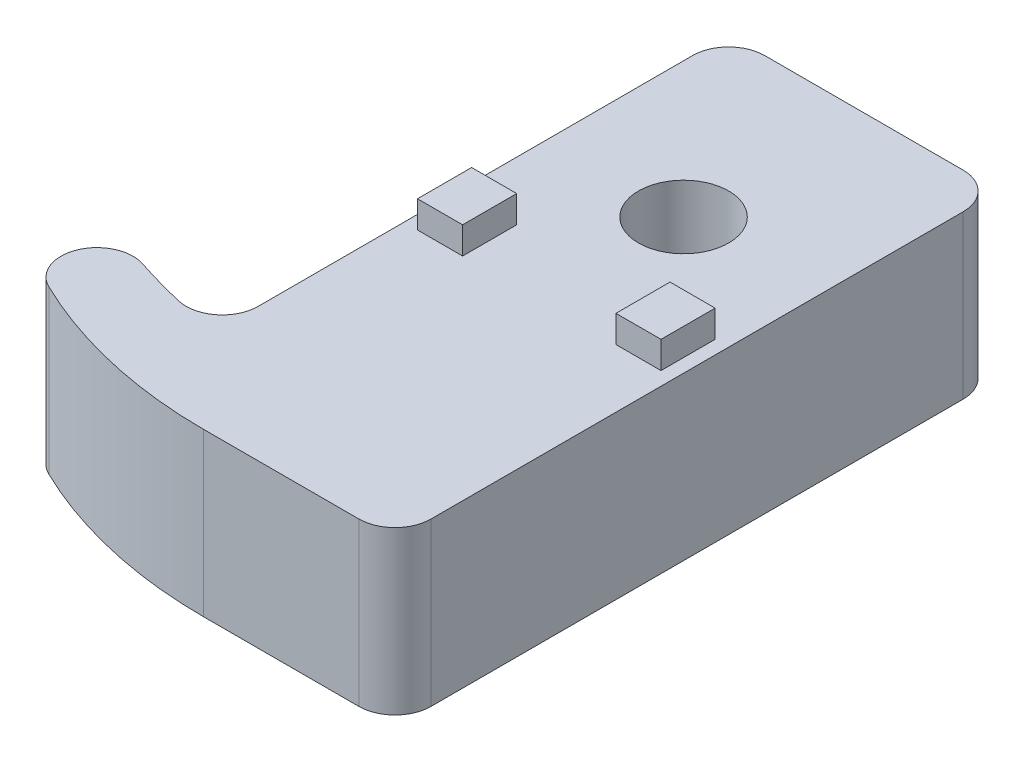
ISO-10303-21;
HEADER;
FILE_DESCRIPTION(('STEP AP214'),'2;1');
FILE_NAME('part.step','',(''),(''),'','','');
FILE_SCHEMA(('AUTOMOTIVE_DESIGN { 1 0 10303 214 1 1 1 1 }'));
ENDSEC;
DATA;
#1=APPLICATION_CONTEXT('core data for automotive mechanical design processes');
#2=APPLICATION_PROTOCOL_DEFINITION('international standard','automotive_design',2000,#1);
#3=PRODUCT_CONTEXT('',#1,'mechanical');
#4=PRODUCT('Part','Part','',(#3));
#5=PRODUCT_RELATED_PRODUCT_CATEGORY('part','',(#4));
#6=PRODUCT_DEFINITION_FORMATION('','',#4);
#7=PRODUCT_DEFINITION_CONTEXT('part definition',#1,'design');
#8=PRODUCT_DEFINITION('design','',#6,#7);
#9=PRODUCT_DEFINITION_SHAPE('','',#8);
#10=(LENGTH_UNIT() NAMED_UNIT(*) SI_UNIT(.MILLI.,.METRE.));
#11=(NAMED_UNIT(*) PLANE_ANGLE_UNIT() SI_UNIT($,.RADIAN.));
#12=(NAMED_UNIT(*) SI_UNIT($,.STERADIAN.) SOLID_ANGLE_UNIT());
#13=UNCERTAINTY_MEASURE_WITH_UNIT(LENGTH_MEASURE(1.E-05),#10,'distance_accuracy_value','');
#14=(GEOMETRIC_REPRESENTATION_CONTEXT(3) GLOBAL_UNCERTAINTY_ASSIGNED_CONTEXT((#13)) GLOBAL_UNIT_ASSIGNED_CONTEXT((#10,
#11,#12)) REPRESENTATION_CONTEXT('',''));
#15=CARTESIAN_POINT('',(0.,0.,0.));
#16=DIRECTION('',(0.,0.,1.));
#17=DIRECTION('',(1.,0.,0.));
#18=AXIS2_PLACEMENT_3D('',#15,#16,#17);
#19=CARTESIAN_POINT('',(-4.38283588510858,-0.000999999999999265,-31.5));
#20=DIRECTION('',(0.,0.,-1.));
#21=DIRECTION('',(-1.,0.,0.));
#22=AXIS2_PLACEMENT_3D('',#19,#20,#21);
#23=PLANE('',#22);
#24=DIRECTION('',(0.,1.,0.));
#25=VECTOR('',#24,1.);
#26=CARTESIAN_POINT('',(8.61716411489142,-0.000999999999999265,-31.5));
#27=LINE('',#26,#25);
#28=CARTESIAN_POINT('',(8.61716411489142,0.,-31.5));
#29=VERTEX_POINT('',#28);
#30=CARTESIAN_POINT('',(8.61716411489142,1.5,-31.5));
#31=VERTEX_POINT('',#30);
#32=EDGE_CURVE('E236',#29,#31,#27,.T.);
#33=ORIENTED_EDGE('',*,*,#32,.T.);
#34=DIRECTION('',(1.,0.,0.));
#35=VECTOR('',#34,1.);
#36=CARTESIAN_POINT('',(8.61716411489144,1.5,-31.5));
#37=LINE('',#36,#35);
#38=CARTESIAN_POINT('',(-4.38283588510858,1.5,-31.5));
#39=VERTEX_POINT('',#38);
#40=EDGE_CURVE('E221',#39,#31,#37,.T.);
#41=ORIENTED_EDGE('',*,*,#40,.F.);
#42=DIRECTION('',(0.,-1.,0.));
#43=VECTOR('',#42,1.);
#44=CARTESIAN_POINT('',(-4.38283588510858,9.,-31.5));
#45=LINE('',#44,#43);
#46=CARTESIAN_POINT('',(-4.38283588510858,0.,-31.5));
#47=VERTEX_POINT('',#46);
#48=EDGE_CURVE('E233',#39,#47,#45,.T.);
#49=ORIENTED_EDGE('',*,*,#48,.T.);
#50=DIRECTION('',(-1.,0.,0.));
#51=VECTOR('',#50,1.);
#52=CARTESIAN_POINT('',(-4.38283588510858,0.,-31.5));
#53=LINE('',#52,#51);
#54=EDGE_CURVE('E504',#29,#47,#53,.T.);
#55=ORIENTED_EDGE('',*,*,#54,.F.);
#56=EDGE_LOOP('',(#33,#41,#49,#55));
#57=FACE_BOUND('',#56,.T.);
#58=ADVANCED_FACE('F41',(#57),#23,.F.);
#59=CARTESIAN_POINT('',(-2.38283588510858,9.,-33.5));
#60=DIRECTION('',(0.,0.,1.));
#61=DIRECTION('',(1.,0.,0.));
#62=AXIS2_PLACEMENT_3D('',#59,#60,#61);
#63=PLANE('',#62);
#64=DIRECTION('',(0.,-1.,0.));
#65=VECTOR('',#64,1.);
#66=CARTESIAN_POINT('',(-2.38283588510858,9.,-33.5));
#67=LINE('',#66,#65);
#68=CARTESIAN_POINT('',(-2.38283588510858,1.5,-33.5));
#69=VERTEX_POINT('',#68);
#70=CARTESIAN_POINT('',(-2.38283588510858,0.,-33.5));
#71=VERTEX_POINT('',#70);
#72=EDGE_CURVE('E258',#69,#71,#67,.T.);
#73=ORIENTED_EDGE('',*,*,#72,.F.);
#74=DIRECTION('',(-1.,0.,0.));
#75=VECTOR('',#74,1.);
#76=CARTESIAN_POINT('',(8.61716411489142,1.5,-33.5));
#77=LINE('',#76,#75);
#78=CARTESIAN_POINT('',(8.61716411489142,1.5,-33.5));
#79=VERTEX_POINT('',#78);
#80=EDGE_CURVE('E224',#79,#69,#77,.T.);
#81=ORIENTED_EDGE('',*,*,#80,.F.);
#82=DIRECTION('',(0.,-1.,0.));
#83=VECTOR('',#82,1.);
#84=CARTESIAN_POINT('',(8.61716411489142,9.,-33.5));
#85=LINE('',#84,#83);
#86=CARTESIAN_POINT('',(8.61716411489142,0.,-33.5));
#87=VERTEX_POINT('',#86);
#88=EDGE_CURVE('E268',#79,#87,#85,.T.);
#89=ORIENTED_EDGE('',*,*,#88,.T.);
#90=DIRECTION('',(-1.,0.,0.));
#91=VECTOR('',#90,1.);
#92=CARTESIAN_POINT('',(-2.38283588510858,0.,-33.5));
#93=LINE('',#92,#91);
#94=EDGE_CURVE('E313',#87,#71,#93,.T.);
#95=ORIENTED_EDGE('',*,*,#94,.T.);
#96=EDGE_LOOP('',(#73,#81,#89,#95));
#97=FACE_BOUND('',#96,.T.);
#98=ADVANCED_FACE('F570',(#97),#63,.F.);
#99=CARTESIAN_POINT('',(-2.38283588510858,9.,-31.5));
#100=DIRECTION('',(0.,-1.,0.));
#101=DIRECTION('',(0.,0.,-1.));
#102=AXIS2_PLACEMENT_3D('',#99,#100,#101);
#103=CYLINDRICAL_SURFACE('',#102,2.);
#104=ORIENTED_EDGE('',*,*,#48,.F.);
#105=CARTESIAN_POINT('',(-2.38283588510858,1.5,-31.5));
#106=DIRECTION('',(0.,-1.,0.));
#107=DIRECTION('',(1.,0.,0.));
#108=AXIS2_PLACEMENT_3D('',#105,#106,#107);
#109=CIRCLE('',#108,2.);
#110=EDGE_CURVE('E218',#69,#39,#109,.F.);
#111=ORIENTED_EDGE('',*,*,#110,.F.);
#112=ORIENTED_EDGE('',*,*,#72,.T.);
#113=CARTESIAN_POINT('',(-2.38283588510858,0.,-31.5));
#114=DIRECTION('',(0.,1.,0.));
#115=DIRECTION('',(0.,0.,1.));
#116=AXIS2_PLACEMENT_3D('',#113,#114,#115);
#117=CIRCLE('',#116,2.);
#118=EDGE_CURVE('E244',#71,#47,#117,.T.);
#119=ORIENTED_EDGE('',*,*,#118,.T.);
#120=EDGE_LOOP('',(#104,#111,#112,#119));
#121=FACE_BOUND('',#120,.T.);
#122=ADVANCED_FACE('F242',(#121),#103,.T.);
#123=CARTESIAN_POINT('',(-4.38283588510858,8.,-31.5));
#124=VERTEX_POINT('',#123);
#125=CARTESIAN_POINT('',(-4.38283588510858,2.5,-31.5));
#126=VERTEX_POINT('',#125);
#127=EDGE_CURVE('E246',#124,#126,#45,.T.);
#128=ORIENTED_EDGE('',*,*,#127,.T.);
#129=DIRECTION('',(-1.,0.,0.));
#130=VECTOR('',#129,1.);
#131=CARTESIAN_POINT('',(8.61716411489144,2.5,-31.5));
#132=LINE('',#131,#130);
#133=CARTESIAN_POINT('',(8.61716411489142,2.5,-31.5));
#134=VERTEX_POINT('',#133);
#135=EDGE_CURVE('E57',#134,#126,#132,.T.);
#136=ORIENTED_EDGE('',*,*,#135,.F.);
#137=CARTESIAN_POINT('',(8.61716411489142,8.,-31.5));
#138=VERTEX_POINT('',#137);
#139=EDGE_CURVE('E508',#134,#138,#27,.T.);
#140=ORIENTED_EDGE('',*,*,#139,.T.);
#141=DIRECTION('',(-1.,0.,0.));
#142=VECTOR('',#141,1.);
#143=CARTESIAN_POINT('',(8.61716411489142,8.,-31.5));
#144=LINE('',#143,#142);
#145=EDGE_CURVE('E65',#138,#124,#144,.T.);
#146=ORIENTED_EDGE('',*,*,#145,.T.);
#147=EDGE_LOOP('',(#128,#136,#140,#146));
#148=FACE_BOUND('',#147,.T.);
#149=ADVANCED_FACE('F590',(#148),#23,.F.);
#150=CARTESIAN_POINT('',(8.61716411489142,-0.000999999999999265,-31.5));
#151=DIRECTION('',(1.,0.,0.));
#152=DIRECTION('',(0.,0.,-1.));
#153=AXIS2_PLACEMENT_3D('',#150,#151,#152);
#154=PLANE('',#153);
#155=DIRECTION('',(0.,0.,-1.));
#156=VECTOR('',#155,1.);
#157=CARTESIAN_POINT('',(8.61716411489142,8.,-30.));
#158=LINE('',#157,#156);
#159=CARTESIAN_POINT('',(8.61716411489142,8.,-30.));
#160=VERTEX_POINT('',#159);
#161=EDGE_CURVE('E522',#160,#138,#158,.T.);
#162=ORIENTED_EDGE('',*,*,#161,.T.);
#163=ORIENTED_EDGE('',*,*,#139,.F.);
#164=DIRECTION('',(0.,0.,-1.));
#165=VECTOR('',#164,1.);
#166=CARTESIAN_POINT('',(8.61716411489144,2.5,0.001000000000001));
#167=LINE('',#166,#165);
#168=CARTESIAN_POINT('',(8.61716411489142,2.5,-33.5));
#169=VERTEX_POINT('',#168);
#170=EDGE_CURVE('E239',#134,#169,#167,.T.);
#171=ORIENTED_EDGE('',*,*,#170,.T.);
#172=DIRECTION('',(0.,-1.,0.));
#173=VECTOR('',#172,1.);
#174=CARTESIAN_POINT('',(8.61716411489142,2.5,-33.5));
#175=LINE('',#174,#173);
#176=EDGE_CURVE('E539',#169,#79,#175,.T.);
#177=ORIENTED_EDGE('',*,*,#176,.T.);
#178=DIRECTION('',(0.,0.,-1.));
#179=VECTOR('',#178,1.);
#180=CARTESIAN_POINT('',(8.61716411489144,1.5,0.001000000000001));
#181=LINE('',#180,#179);
#182=EDGE_CURVE('E528',#31,#79,#181,.T.);
#183=ORIENTED_EDGE('',*,*,#182,.F.);
#184=ORIENTED_EDGE('',*,*,#32,.F.);
#185=DIRECTION('',(0.,0.,-1.));
#186=VECTOR('',#185,1.);
#187=CARTESIAN_POINT('',(8.61716411489142,0.,-31.5));
#188=LINE('',#187,#186);
#189=CARTESIAN_POINT('',(8.61716411489142,0.,-30.));
#190=VERTEX_POINT('',#189);
#191=EDGE_CURVE('E513',#190,#29,#188,.T.);
#192=ORIENTED_EDGE('',*,*,#191,.F.);
#193=DIRECTION('',(0.,1.,0.));
#194=VECTOR('',#193,1.);
#195=CARTESIAN_POINT('',(8.61716411489142,-0.000999999999999265,-30.));
#196=LINE('',#195,#194);
#197=EDGE_CURVE('E503',#190,#160,#196,.T.);
#198=ORIENTED_EDGE('',*,*,#197,.T.);
#199=EDGE_LOOP('',(#162,#163,#171,#177,#183,#184,#192,#198));
#200=FACE_BOUND('',#199,.T.);
#201=ADVANCED_FACE('F567',(#200),#154,.F.);
#202=CARTESIAN_POINT('',(-4.38283588510858,-0.000999999999999265,-30.));
#203=DIRECTION('',(0.,0.,1.));
#204=DIRECTION('',(1.,0.,0.));
#205=AXIS2_PLACEMENT_3D('',#202,#203,#204);
#206=PLANE('',#205);
#207=DIRECTION('',(1.,0.,0.));
#208=VECTOR('',#207,1.);
#209=CARTESIAN_POINT('',(-4.38283588510858,8.,-30.));
#210=LINE('',#209,#208);
#211=CARTESIAN_POINT('',(-4.38283588510858,8.,-30.));
#212=VERTEX_POINT('',#211);
#213=EDGE_CURVE('E238',#212,#160,#210,.T.);
#214=ORIENTED_EDGE('',*,*,#213,.T.);
#215=ORIENTED_EDGE('',*,*,#197,.F.);
#216=DIRECTION('',(1.,0.,0.));
#217=VECTOR('',#216,1.);
#218=CARTESIAN_POINT('',(-4.38283588510858,0.,-30.));
#219=LINE('',#218,#217);
#220=CARTESIAN_POINT('',(-4.38283588510858,0.,-30.));
#221=VERTEX_POINT('',#220);
#222=EDGE_CURVE('E485',#221,#190,#219,.T.);
#223=ORIENTED_EDGE('',*,*,#222,.F.);
#224=DIRECTION('',(0.,1.,0.));
#225=VECTOR('',#224,1.);
#226=CARTESIAN_POINT('',(-4.38283588510858,-0.000999999999999265,-30.));
#227=LINE('',#226,#225);
#228=EDGE_CURVE('E500',#221,#212,#227,.T.);
#229=ORIENTED_EDGE('',*,*,#228,.T.);
#230=EDGE_LOOP('',(#214,#215,#223,#229));
#231=FACE_BOUND('',#230,.T.);
#232=ADVANCED_FACE('F575',(#231),#206,.F.);
#233=CARTESIAN_POINT('',(0.,9.,-25.5));
#234=DIRECTION('',(0.,-1.,0.));
#235=DIRECTION('',(0.,0.,-1.));
#236=AXIS2_PLACEMENT_3D('',#233,#234,#235);
#237=PLANE('',#236);
#238=CARTESIAN_POINT('',(-2.38283588510858,9.,-31.5));
#239=DIRECTION('',(0.,1.,0.));
#240=DIRECTION('',(0.,0.,1.));
#241=AXIS2_PLACEMENT_3D('',#238,#239,#240);
#242=CIRCLE('',#241,2.);
#243=CARTESIAN_POINT('',(-2.38283588510858,9.,-33.5));
#244=VERTEX_POINT('',#243);
#245=CARTESIAN_POINT('',(-4.38283588510858,9.,-31.5));
#246=VERTEX_POINT('',#245);
#247=EDGE_CURVE('E384',#244,#246,#242,.T.);
#248=ORIENTED_EDGE('',*,*,#247,.T.);
#249=DIRECTION('',(0.,0.,1.));
#250=VECTOR('',#249,1.);
#251=CARTESIAN_POINT('',(-4.38283588510857,9.,-7.42105961310574));
#252=LINE('',#251,#250);
#253=CARTESIAN_POINT('',(-4.38283588510857,9.,-7.42105961310574));
#254=VERTEX_POINT('',#253);
#255=EDGE_CURVE('E388',#246,#254,#252,.T.);
#256=ORIENTED_EDGE('',*,*,#255,.T.);
#257=CARTESIAN_POINT('',(-6.38283588510857,9.,-7.42105961310574));
#258=DIRECTION('',(0.,-1.,0.));
#259=DIRECTION('',(0.,0.,1.));
#260=AXIS2_PLACEMENT_3D('',#257,#258,#259);
#261=CIRCLE('',#260,2.);
#262=CARTESIAN_POINT('',(-6.83639449681552,9.,-5.47316726860966));
#263=VERTEX_POINT('',#262);
#264=EDGE_CURVE('E391',#254,#263,#261,.T.);
#265=ORIENTED_EDGE('',*,*,#264,.T.);
#266=CARTESIAN_POINT('',(0.571114599262993,9.,-37.2861014464734));
#267=DIRECTION('',(0.,-1.,0.));
#268=DIRECTION('',(0.,0.,-1.));
#269=AXIS2_PLACEMENT_3D('',#266,#267,#268);
#270=CIRCLE('',#269,32.6639552414213);
#271=CARTESIAN_POINT('',(-9.63328234827252,9.,-6.25701420642225));
#272=VERTEX_POINT('',#271);
#273=EDGE_CURVE('E348',#263,#272,#270,.T.);
#274=ORIENTED_EDGE('',*,*,#273,.T.);
#275=CARTESIAN_POINT('',(-10.2580932061196,9.,-4.35711647445971));
#276=DIRECTION('',(0.,1.,0.));
#277=DIRECTION('',(0.,0.,-1.));
#278=AXIS2_PLACEMENT_3D('',#275,#276,#277);
#279=CIRCLE('',#278,2.);
#280=CARTESIAN_POINT('',(-11.1311224151511,9.,-2.55772213186054));
#281=VERTEX_POINT('',#280);
#282=EDGE_CURVE('E336',#272,#281,#279,.T.);
#283=ORIENTED_EDGE('',*,*,#282,.T.);
#284=CARTESIAN_POINT('',(0.,9.,-25.5));
#285=DIRECTION('',(0.,1.,0.));
#286=DIRECTION('',(0.,0.,-1.));
#287=AXIS2_PLACEMENT_3D('',#284,#285,#286);
#288=CIRCLE('',#287,25.5);
#289=CARTESIAN_POINT('',(0.,9.,0.));
#290=VERTEX_POINT('',#289);
#291=EDGE_CURVE('E330',#281,#290,#288,.T.);
#292=ORIENTED_EDGE('',*,*,#291,.T.);
#293=DIRECTION('',(1.,0.,0.));
#294=VECTOR('',#293,1.);
#295=CARTESIAN_POINT('',(8.61716411489142,9.,0.));
#296=LINE('',#295,#294);
#297=CARTESIAN_POINT('',(8.61716411489142,9.,0.));
#298=VERTEX_POINT('',#297);
#299=EDGE_CURVE('E365',#290,#298,#296,.T.);
#300=ORIENTED_EDGE('',*,*,#299,.T.);
#301=CARTESIAN_POINT('',(8.61716411489143,9.,-2.));
#302=DIRECTION('',(0.,1.,0.));
#303=DIRECTION('',(0.,0.,-1.));
#304=AXIS2_PLACEMENT_3D('',#301,#302,#303);
#305=CIRCLE('',#304,2.);
#306=CARTESIAN_POINT('',(10.6171641148914,9.,-2.00000000000001));
#307=VERTEX_POINT('',#306);
#308=EDGE_CURVE('E290',#298,#307,#305,.T.);
#309=ORIENTED_EDGE('',*,*,#308,.T.);
#310=DIRECTION('',(0.,0.,-1.));
#311=VECTOR('',#310,1.);
#312=CARTESIAN_POINT('',(10.6171641148914,9.,-31.5));
#313=LINE('',#312,#311);
#314=CARTESIAN_POINT('',(10.6171641148914,9.,-31.5));
#315=VERTEX_POINT('',#314);
#316=EDGE_CURVE('E375',#307,#315,#313,.T.);
#317=ORIENTED_EDGE('',*,*,#316,.T.);
#318=CARTESIAN_POINT('',(8.61716411489142,9.,-31.5));
#319=DIRECTION('',(0.,1.,0.));
#320=DIRECTION('',(0.,0.,-1.));
#321=AXIS2_PLACEMENT_3D('',#318,#319,#320);
#322=CIRCLE('',#321,2.);
#323=CARTESIAN_POINT('',(8.61716411489142,9.,-33.5));
#324=VERTEX_POINT('',#323);
#325=EDGE_CURVE('E378',#315,#324,#322,.T.);
#326=ORIENTED_EDGE('',*,*,#325,.T.);
#327=DIRECTION('',(-1.,0.,0.));
#328=VECTOR('',#327,1.);
#329=CARTESIAN_POINT('',(-2.38283588510858,9.,-33.5));
#330=LINE('',#329,#328);
#331=EDGE_CURVE('E381',#324,#244,#330,.T.);
#332=ORIENTED_EDGE('',*,*,#331,.T.);
#333=EDGE_LOOP('',(#248,#256,#265,#274,#283,#292,#300,#309,#317,#326,#332));
#334=FACE_BOUND('',#333,.T.);
#335=DIRECTION('',(0.,0.,1.));
#336=VECTOR('',#335,1.);
#337=CARTESIAN_POINT('',(-3.63283588510858,9.,-18.5));
#338=LINE('',#337,#336);
#339=CARTESIAN_POINT('',(-3.63283588510858,9.,-18.5));
#340=VERTEX_POINT('',#339);
#341=CARTESIAN_POINT('',(-3.63283588510858,9.,-15.5));
#342=VERTEX_POINT('',#341);
#343=EDGE_CURVE('E436',#340,#342,#338,.T.);
#344=ORIENTED_EDGE('',*,*,#343,.F.);
#345=DIRECTION('',(-1.,0.,0.));
#346=VECTOR('',#345,1.);
#347=CARTESIAN_POINT('',(-3.63283588510858,9.,-18.5));
#348=LINE('',#347,#346);
#349=CARTESIAN_POINT('',(-1.13283588510858,9.,-18.5));
#350=VERTEX_POINT('',#349);
#351=EDGE_CURVE('E423',#350,#340,#348,.T.);
#352=ORIENTED_EDGE('',*,*,#351,.F.);
#353=DIRECTION('',(0.,0.,-1.));
#354=VECTOR('',#353,1.);
#355=CARTESIAN_POINT('',(-1.13283588510858,9.,-18.5));
#356=LINE('',#355,#354);
#357=CARTESIAN_POINT('',(-1.13283588510858,9.,-15.5));
#358=VERTEX_POINT('',#357);
#359=EDGE_CURVE('E428',#358,#350,#356,.T.);
#360=ORIENTED_EDGE('',*,*,#359,.F.);
#361=DIRECTION('',(1.,0.,0.));
#362=VECTOR('',#361,1.);
#363=CARTESIAN_POINT('',(-3.63283588510858,9.,-15.5));
#364=LINE('',#363,#362);
#365=EDGE_CURVE('E432',#342,#358,#364,.T.);
#366=ORIENTED_EDGE('',*,*,#365,.F.);
#367=EDGE_LOOP('',(#344,#352,#360,#366));
#368=FACE_BOUND('',#367,.T.);
#369=CARTESIAN_POINT('',(3.11716411489142,9.,-23.5));
#370=DIRECTION('',(0.,1.,0.));
#371=DIRECTION('',(0.,0.,1.));
#372=AXIS2_PLACEMENT_3D('',#369,#370,#371);
#373=CIRCLE('',#372,2.5);
#374=CARTESIAN_POINT('',(3.11716411489142,9.,-21.));
#375=VERTEX_POINT('',#374);
#376=EDGE_CURVE('E398',#375,#375,#373,.T.);
#377=ORIENTED_EDGE('',*,*,#376,.F.);
#378=EDGE_LOOP('',(#377));
#379=FACE_BOUND('',#378,.T.);
#380=DIRECTION('',(-1.,0.,0.));
#381=VECTOR('',#380,1.);
#382=CARTESIAN_POINT('',(9.86716411489142,9.,-18.5));
#383=LINE('',#382,#381);
#384=CARTESIAN_POINT('',(9.86716411489142,9.,-18.5));
#385=VERTEX_POINT('',#384);
#386=CARTESIAN_POINT('',(7.36716411489142,9.,-18.5));
#387=VERTEX_POINT('',#386);
#388=EDGE_CURVE('E481',#385,#387,#383,.T.);
#389=ORIENTED_EDGE('',*,*,#388,.F.);
#390=DIRECTION('',(0.,0.,-1.));
#391=VECTOR('',#390,1.);
#392=CARTESIAN_POINT('',(9.86716411489142,9.,-18.5));
#393=LINE('',#392,#391);
#394=CARTESIAN_POINT('',(9.86716411489142,9.,-15.5));
#395=VERTEX_POINT('',#394);
#396=EDGE_CURVE('E468',#395,#385,#393,.T.);
#397=ORIENTED_EDGE('',*,*,#396,.F.);
#398=DIRECTION('',(1.,0.,0.));
#399=VECTOR('',#398,1.);
#400=CARTESIAN_POINT('',(9.86716411489142,9.,-15.5));
#401=LINE('',#400,#399);
#402=CARTESIAN_POINT('',(7.36716411489142,9.,-15.5));
#403=VERTEX_POINT('',#402);
#404=EDGE_CURVE('E473',#403,#395,#401,.T.);
#405=ORIENTED_EDGE('',*,*,#404,.F.);
#406=DIRECTION('',(0.,0.,1.));
#407=VECTOR('',#406,1.);
#408=CARTESIAN_POINT('',(7.36716411489142,9.,-18.5));
#409=LINE('',#408,#407);
#410=EDGE_CURVE('E477',#387,#403,#409,.T.);
#411=ORIENTED_EDGE('',*,*,#410,.F.);
#412=EDGE_LOOP('',(#389,#397,#405,#411));
#413=FACE_BOUND('',#412,.T.);
#414=ADVANCED_FACE('F557',(#334,#368,#379,#413),#237,.F.);
#415=CARTESIAN_POINT('',(0.,0.,-25.5));
#416=DIRECTION('',(0.,-1.,0.));
#417=DIRECTION('',(0.,0.,-1.));
#418=AXIS2_PLACEMENT_3D('',#415,#416,#417);
#419=PLANE('',#418);
#420=ORIENTED_EDGE('',*,*,#54,.T.);
#421=ORIENTED_EDGE('',*,*,#118,.F.);
#422=ORIENTED_EDGE('',*,*,#94,.F.);
#423=CARTESIAN_POINT('',(8.61716411489142,0.,-31.5));
#424=DIRECTION('',(0.,1.,0.));
#425=DIRECTION('',(0.,0.,-1.));
#426=AXIS2_PLACEMENT_3D('',#423,#424,#425);
#427=CIRCLE('',#426,2.);
#428=CARTESIAN_POINT('',(10.6171641148914,0.,-31.5));
#429=VERTEX_POINT('',#428);
#430=EDGE_CURVE('E304',#429,#87,#427,.T.);
#431=ORIENTED_EDGE('',*,*,#430,.F.);
#432=DIRECTION('',(0.,0.,-1.));
#433=VECTOR('',#432,1.);
#434=CARTESIAN_POINT('',(10.6171641148914,0.,-31.5));
#435=LINE('',#434,#433);
#436=CARTESIAN_POINT('',(10.6171641148914,0.,-2.00000000000001));
#437=VERTEX_POINT('',#436);
#438=EDGE_CURVE('E299',#437,#429,#435,.T.);
#439=ORIENTED_EDGE('',*,*,#438,.F.);
#440=CARTESIAN_POINT('',(8.61716411489143,0.,-2.));
#441=DIRECTION('',(0.,1.,0.));
#442=DIRECTION('',(0.,0.,-1.));
#443=AXIS2_PLACEMENT_3D('',#440,#441,#442);
#444=CIRCLE('',#443,2.);
#445=CARTESIAN_POINT('',(8.61716411489142,0.,0.));
#446=VERTEX_POINT('',#445);
#447=EDGE_CURVE('E289',#446,#437,#444,.T.);
#448=ORIENTED_EDGE('',*,*,#447,.F.);
#449=DIRECTION('',(1.,0.,0.));
#450=VECTOR('',#449,1.);
#451=CARTESIAN_POINT('',(8.61716411489142,0.,0.));
#452=LINE('',#451,#450);
#453=CARTESIAN_POINT('',(0.,0.,0.));
#454=VERTEX_POINT('',#453);
#455=EDGE_CURVE('E297',#454,#446,#452,.T.);
#456=ORIENTED_EDGE('',*,*,#455,.F.);
#457=CARTESIAN_POINT('',(0.,0.,-25.5));
#458=DIRECTION('',(0.,1.,0.));
#459=DIRECTION('',(0.,0.,-1.));
#460=AXIS2_PLACEMENT_3D('',#457,#458,#459);
#461=CIRCLE('',#460,25.5);
#462=CARTESIAN_POINT('',(-11.1311224151511,0.,-2.55772213186054));
#463=VERTEX_POINT('',#462);
#464=EDGE_CURVE('E306',#463,#454,#461,.T.);
#465=ORIENTED_EDGE('',*,*,#464,.F.);
#466=CARTESIAN_POINT('',(-10.2580932061196,0.,-4.35711647445971));
#467=DIRECTION('',(0.,1.,0.));
#468=DIRECTION('',(0.,0.,-1.));
#469=AXIS2_PLACEMENT_3D('',#466,#467,#468);
#470=CIRCLE('',#469,2.);
#471=CARTESIAN_POINT('',(-9.63328234827252,0.,-6.25701420642225));
#472=VERTEX_POINT('',#471);
#473=EDGE_CURVE('E327',#472,#463,#470,.T.);
#474=ORIENTED_EDGE('',*,*,#473,.F.);
#475=CARTESIAN_POINT('',(0.571114599262993,0.,-37.2861014464734));
#476=DIRECTION('',(0.,-1.,0.));
#477=DIRECTION('',(0.,0.,-1.));
#478=AXIS2_PLACEMENT_3D('',#475,#476,#477);
#479=CIRCLE('',#478,32.6639552414213);
#480=CARTESIAN_POINT('',(-6.83639449681552,0.,-5.47316726860966));
#481=VERTEX_POINT('',#480);
#482=EDGE_CURVE('E324',#481,#472,#479,.T.);
#483=ORIENTED_EDGE('',*,*,#482,.F.);
#484=CARTESIAN_POINT('',(-6.38283588510857,0.,-7.42105961310574));
#485=DIRECTION('',(0.,-1.,0.));
#486=DIRECTION('',(0.,0.,1.));
#487=AXIS2_PLACEMENT_3D('',#484,#485,#486);
#488=CIRCLE('',#487,2.);
#489=CARTESIAN_POINT('',(-4.38283588510857,0.,-7.42105961310574));
#490=VERTEX_POINT('',#489);
#491=EDGE_CURVE('E321',#490,#481,#488,.T.);
#492=ORIENTED_EDGE('',*,*,#491,.F.);
#493=DIRECTION('',(0.,0.,1.));
#494=VECTOR('',#493,1.);
#495=CARTESIAN_POINT('',(-4.38283588510857,0.,-7.42105961310574));
#496=LINE('',#495,#494);
#497=EDGE_CURVE('E318',#221,#490,#496,.T.);
#498=ORIENTED_EDGE('',*,*,#497,.F.);
#499=ORIENTED_EDGE('',*,*,#222,.T.);
#500=ORIENTED_EDGE('',*,*,#191,.T.);
#501=EDGE_LOOP('',(#420,#421,#422,#431,#439,#448,#456,#465,#474,#483,#492,#498,#499,#500));
#502=FACE_BOUND('',#501,.T.);
#503=CARTESIAN_POINT('',(3.11716411489142,0.,-23.5));
#504=DIRECTION('',(0.,1.,0.));
#505=DIRECTION('',(0.,0.,1.));
#506=AXIS2_PLACEMENT_3D('',#503,#504,#505);
#507=CIRCLE('',#506,2.5);
#508=CARTESIAN_POINT('',(3.11716411489142,0.,-21.));
#509=VERTEX_POINT('',#508);
#510=EDGE_CURVE('E370',#509,#509,#507,.T.);
#511=ORIENTED_EDGE('',*,*,#510,.T.);
#512=EDGE_LOOP('',(#511));
#513=FACE_BOUND('',#512,.T.);
#514=ADVANCED_FACE('F294',(#502,#513),#419,.T.);
#515=CARTESIAN_POINT('',(0.,9.,-25.5));
#516=DIRECTION('',(0.,-1.,0.));
#517=DIRECTION('',(0.,0.,-1.));
#518=AXIS2_PLACEMENT_3D('',#515,#516,#517);
#519=CYLINDRICAL_SURFACE('',#518,25.5);
#520=ORIENTED_EDGE('',*,*,#464,.T.);
#521=DIRECTION('',(0.,-1.,0.));
#522=VECTOR('',#521,1.);
#523=CARTESIAN_POINT('',(0.,9.,0.));
#524=LINE('',#523,#522);
#525=EDGE_CURVE('E11',#290,#454,#524,.T.);
#526=ORIENTED_EDGE('',*,*,#525,.F.);
#527=ORIENTED_EDGE('',*,*,#291,.F.);
#528=DIRECTION('',(0.,-1.,0.));
#529=VECTOR('',#528,1.);
#530=CARTESIAN_POINT('',(-11.1311224151511,9.,-2.55772213186054));
#531=LINE('',#530,#529);
#532=EDGE_CURVE('E331',#281,#463,#531,.T.);
#533=ORIENTED_EDGE('',*,*,#532,.T.);
#534=EDGE_LOOP('',(#520,#526,#527,#533));
#535=FACE_BOUND('',#534,.T.);
#536=ADVANCED_FACE('F43',(#535),#519,.T.);
#537=CARTESIAN_POINT('',(8.61716411489142,9.,0.));
#538=DIRECTION('',(0.,0.,-1.));
#539=DIRECTION('',(-1.,0.,0.));
#540=AXIS2_PLACEMENT_3D('',#537,#538,#539);
#541=PLANE('',#540);
#542=ORIENTED_EDGE('',*,*,#455,.T.);
#543=DIRECTION('',(0.,-1.,0.));
#544=VECTOR('',#543,1.);
#545=CARTESIAN_POINT('',(8.61716411489142,9.,0.));
#546=LINE('',#545,#544);
#547=EDGE_CURVE('E50',#298,#446,#546,.T.);
#548=ORIENTED_EDGE('',*,*,#547,.F.);
#549=ORIENTED_EDGE('',*,*,#299,.F.);
#550=ORIENTED_EDGE('',*,*,#525,.T.);
#551=EDGE_LOOP('',(#542,#548,#549,#550));
#552=FACE_BOUND('',#551,.T.);
#553=ADVANCED_FACE('F852',(#552),#541,.F.);
#554=CARTESIAN_POINT('',(8.61716411489143,9.,-2.));
#555=DIRECTION('',(0.,-1.,0.));
#556=DIRECTION('',(0.,0.,-1.));
#557=AXIS2_PLACEMENT_3D('',#554,#555,#556);
#558=CYLINDRICAL_SURFACE('',#557,2.);
#559=ORIENTED_EDGE('',*,*,#447,.T.);
#560=DIRECTION('',(0.,-1.,0.));
#561=VECTOR('',#560,1.);
#562=CARTESIAN_POINT('',(10.6171641148914,9.,-2.00000000000001));
#563=LINE('',#562,#561);
#564=EDGE_CURVE('E278',#307,#437,#563,.T.);
#565=ORIENTED_EDGE('',*,*,#564,.F.);
#566=ORIENTED_EDGE('',*,*,#308,.F.);
#567=ORIENTED_EDGE('',*,*,#547,.T.);
#568=EDGE_LOOP('',(#559,#565,#566,#567));
#569=FACE_BOUND('',#568,.T.);
#570=ADVANCED_FACE('F287',(#569),#558,.T.);
#571=CARTESIAN_POINT('',(10.6171641148914,9.,-31.5));
#572=DIRECTION('',(-1.,0.,0.));
#573=DIRECTION('',(0.,0.,1.));
#574=AXIS2_PLACEMENT_3D('',#571,#572,#573);
#575=PLANE('',#574);
#576=ORIENTED_EDGE('',*,*,#438,.T.);
#577=DIRECTION('',(0.,-1.,0.));
#578=VECTOR('',#577,1.);
#579=CARTESIAN_POINT('',(10.6171641148914,9.,-31.5));
#580=LINE('',#579,#578);
#581=EDGE_CURVE('E274',#315,#429,#580,.T.);
#582=ORIENTED_EDGE('',*,*,#581,.F.);
#583=ORIENTED_EDGE('',*,*,#316,.F.);
#584=ORIENTED_EDGE('',*,*,#564,.T.);
#585=EDGE_LOOP('',(#576,#582,#583,#584));
#586=FACE_BOUND('',#585,.T.);
#587=ADVANCED_FACE('F649',(#586),#575,.F.);
#588=CARTESIAN_POINT('',(8.61716411489142,9.,-31.5));
#589=DIRECTION('',(0.,-1.,0.));
#590=DIRECTION('',(0.,0.,-1.));
#591=AXIS2_PLACEMENT_3D('',#588,#589,#590);
#592=CYLINDRICAL_SURFACE('',#591,2.);
#593=ORIENTED_EDGE('',*,*,#430,.T.);
#594=ORIENTED_EDGE('',*,*,#88,.F.);
#595=ORIENTED_EDGE('',*,*,#176,.F.);
#596=EDGE_CURVE('E270',#324,#169,#85,.T.);
#597=ORIENTED_EDGE('',*,*,#596,.F.);
#598=ORIENTED_EDGE('',*,*,#325,.F.);
#599=ORIENTED_EDGE('',*,*,#581,.T.);
#600=EDGE_LOOP('',(#593,#594,#595,#597,#598,#599));
#601=FACE_BOUND('',#600,.T.);
#602=ADVANCED_FACE('F564',(#601),#592,.T.);
#603=ORIENTED_EDGE('',*,*,#596,.T.);
#604=DIRECTION('',(1.,0.,0.));
#605=VECTOR('',#604,1.);
#606=CARTESIAN_POINT('',(8.61716411489142,2.5,-33.5));
#607=LINE('',#606,#605);
#608=CARTESIAN_POINT('',(-2.38283588510858,2.5,-33.5));
#609=VERTEX_POINT('',#608);
#610=EDGE_CURVE('E531',#609,#169,#607,.T.);
#611=ORIENTED_EDGE('',*,*,#610,.F.);
#612=EDGE_CURVE('E264',#244,#609,#67,.T.);
#613=ORIENTED_EDGE('',*,*,#612,.F.);
#614=ORIENTED_EDGE('',*,*,#331,.F.);
#615=EDGE_LOOP('',(#603,#611,#613,#614));
#616=FACE_BOUND('',#615,.T.);
#617=ADVANCED_FACE('F552',(#616),#63,.F.);
#618=ORIENTED_EDGE('',*,*,#612,.T.);
#619=CARTESIAN_POINT('',(-2.38283588510858,2.5,-31.5));
#620=DIRECTION('',(0.,1.,0.));
#621=DIRECTION('',(0.,0.,1.));
#622=AXIS2_PLACEMENT_3D('',#619,#620,#621);
#623=CIRCLE('',#622,2.);
#624=EDGE_CURVE('E229',#126,#609,#623,.F.);
#625=ORIENTED_EDGE('',*,*,#624,.F.);
#626=ORIENTED_EDGE('',*,*,#127,.F.);
#627=EDGE_CURVE('E249',#246,#124,#45,.T.);
#628=ORIENTED_EDGE('',*,*,#627,.F.);
#629=ORIENTED_EDGE('',*,*,#247,.F.);
#630=EDGE_LOOP('',(#618,#625,#626,#628,#629));
#631=FACE_BOUND('',#630,.T.);
#632=ADVANCED_FACE('F556',(#631),#103,.T.);
#633=CARTESIAN_POINT('',(-4.38283588510857,9.,-7.42105961310574));
#634=DIRECTION('',(1.,0.,0.));
#635=DIRECTION('',(0.,0.,-1.));
#636=AXIS2_PLACEMENT_3D('',#633,#634,#635);
#637=PLANE('',#636);
#638=ORIENTED_EDGE('',*,*,#255,.F.);
#639=ORIENTED_EDGE('',*,*,#627,.T.);
#640=DIRECTION('',(0.,0.,1.));
#641=VECTOR('',#640,1.);
#642=CARTESIAN_POINT('',(-4.38283588510858,8.,-31.5));
#643=LINE('',#642,#641);
#644=EDGE_CURVE('E517',#124,#212,#643,.T.);
#645=ORIENTED_EDGE('',*,*,#644,.T.);
#646=ORIENTED_EDGE('',*,*,#228,.F.);
#647=ORIENTED_EDGE('',*,*,#497,.T.);
#648=DIRECTION('',(0.,-1.,0.));
#649=VECTOR('',#648,1.);
#650=CARTESIAN_POINT('',(-4.38283588510857,9.,-7.42105961310574));
#651=LINE('',#650,#649);
#652=EDGE_CURVE('E247',#254,#490,#651,.T.);
#653=ORIENTED_EDGE('',*,*,#652,.F.);
#654=EDGE_LOOP('',(#638,#639,#645,#646,#647,#653));
#655=FACE_BOUND('',#654,.T.);
#656=ADVANCED_FACE('F578',(#655),#637,.F.);
#657=CARTESIAN_POINT('',(-6.38283588510857,9.,-7.42105961310574));
#658=DIRECTION('',(0.,-1.,0.));
#659=DIRECTION('',(0.,0.,-1.));
#660=AXIS2_PLACEMENT_3D('',#657,#658,#659);
#661=CYLINDRICAL_SURFACE('',#660,2.);
#662=ORIENTED_EDGE('',*,*,#491,.T.);
#663=DIRECTION('',(0.,-1.,0.));
#664=VECTOR('',#663,1.);
#665=CARTESIAN_POINT('',(-6.83639449681552,9.,-5.47316726860966));
#666=LINE('',#665,#664);
#667=EDGE_CURVE('E253',#263,#481,#666,.T.);
#668=ORIENTED_EDGE('',*,*,#667,.F.);
#669=ORIENTED_EDGE('',*,*,#264,.F.);
#670=ORIENTED_EDGE('',*,*,#652,.T.);
#671=EDGE_LOOP('',(#662,#668,#669,#670));
#672=FACE_BOUND('',#671,.T.);
#673=ADVANCED_FACE('F579',(#672),#661,.F.);
#674=CARTESIAN_POINT('',(0.571114599262993,9.,-37.2861014464734));
#675=DIRECTION('',(0.,-1.,0.));
#676=DIRECTION('',(0.,0.,-1.));
#677=AXIS2_PLACEMENT_3D('',#674,#675,#676);
#678=CYLINDRICAL_SURFACE('',#677,32.6639552414213);
#679=ORIENTED_EDGE('',*,*,#482,.T.);
#680=DIRECTION('',(0.,-1.,0.));
#681=VECTOR('',#680,1.);
#682=CARTESIAN_POINT('',(-9.63328234827252,9.,-6.25701420642225));
#683=LINE('',#682,#681);
#684=EDGE_CURVE('E335',#272,#472,#683,.T.);
#685=ORIENTED_EDGE('',*,*,#684,.F.);
#686=ORIENTED_EDGE('',*,*,#273,.F.);
#687=ORIENTED_EDGE('',*,*,#667,.T.);
#688=EDGE_LOOP('',(#679,#685,#686,#687));
#689=FACE_BOUND('',#688,.T.);
#690=ADVANCED_FACE('F346',(#689),#678,.F.);
#691=CARTESIAN_POINT('',(-10.2580932061196,9.,-4.35711647445971));
#692=DIRECTION('',(0.,-1.,0.));
#693=DIRECTION('',(0.,0.,-1.));
#694=AXIS2_PLACEMENT_3D('',#691,#692,#693);
#695=CYLINDRICAL_SURFACE('',#694,2.);
#696=ORIENTED_EDGE('',*,*,#473,.T.);
#697=ORIENTED_EDGE('',*,*,#532,.F.);
#698=ORIENTED_EDGE('',*,*,#282,.F.);
#699=ORIENTED_EDGE('',*,*,#684,.T.);
#700=EDGE_LOOP('',(#696,#697,#698,#699));
#701=FACE_BOUND('',#700,.T.);
#702=ADVANCED_FACE('F357',(#701),#695,.T.);
#703=CARTESIAN_POINT('',(3.11716411489142,9.,-23.5));
#704=DIRECTION('',(0.,-1.,0.));
#705=DIRECTION('',(0.,0.,-1.));
#706=AXIS2_PLACEMENT_3D('',#703,#704,#705);
#707=CYLINDRICAL_SURFACE('',#706,2.5);
#708=ORIENTED_EDGE('',*,*,#376,.T.);
#709=EDGE_LOOP('',(#708));
#710=FACE_BOUND('',#709,.T.);
#711=ORIENTED_EDGE('',*,*,#510,.F.);
#712=EDGE_LOOP('',(#711));
#713=FACE_BOUND('',#712,.T.);
#714=ADVANCED_FACE('F809',(#710,#713),#707,.F.);
#715=CARTESIAN_POINT('',(-3.63283588510858,10.5,-18.5));
#716=DIRECTION('',(1.,0.,0.));
#717=DIRECTION('',(0.,0.,-1.));
#718=AXIS2_PLACEMENT_3D('',#715,#716,#717);
#719=PLANE('',#718);
#720=ORIENTED_EDGE('',*,*,#343,.T.);
#721=DIRECTION('',(0.,-1.,0.));
#722=VECTOR('',#721,1.);
#723=CARTESIAN_POINT('',(-3.63283588510858,10.5,-15.5));
#724=LINE('',#723,#722);
#725=CARTESIAN_POINT('',(-3.63283588510858,10.5,-15.5));
#726=VERTEX_POINT('',#725);
#727=EDGE_CURVE('E405',#726,#342,#724,.T.);
#728=ORIENTED_EDGE('',*,*,#727,.F.);
#729=DIRECTION('',(0.,0.,1.));
#730=VECTOR('',#729,1.);
#731=CARTESIAN_POINT('',(-3.63283588510858,10.5,-18.5));
#732=LINE('',#731,#730);
#733=CARTESIAN_POINT('',(-3.63283588510858,10.5,-18.5));
#734=VERTEX_POINT('',#733);
#735=EDGE_CURVE('E427',#734,#726,#732,.T.);
#736=ORIENTED_EDGE('',*,*,#735,.F.);
#737=DIRECTION('',(0.,-1.,0.));
#738=VECTOR('',#737,1.);
#739=CARTESIAN_POINT('',(-3.63283588510858,10.5,-18.5));
#740=LINE('',#739,#738);
#741=EDGE_CURVE('E418',#734,#340,#740,.T.);
#742=ORIENTED_EDGE('',*,*,#741,.T.);
#743=EDGE_LOOP('',(#720,#728,#736,#742));
#744=FACE_BOUND('',#743,.T.);
#745=ADVANCED_FACE('F799',(#744),#719,.F.);
#746=CARTESIAN_POINT('',(-3.63283588510858,10.5,-15.5));
#747=DIRECTION('',(0.,0.,-1.));
#748=DIRECTION('',(-1.,0.,0.));
#749=AXIS2_PLACEMENT_3D('',#746,#747,#748);
#750=PLANE('',#749);
#751=ORIENTED_EDGE('',*,*,#365,.T.);
#752=DIRECTION('',(0.,-1.,0.));
#753=VECTOR('',#752,1.);
#754=CARTESIAN_POINT('',(-1.13283588510858,10.5,-15.5));
#755=LINE('',#754,#753);
#756=CARTESIAN_POINT('',(-1.13283588510858,10.5,-15.5));
#757=VERTEX_POINT('',#756);
#758=EDGE_CURVE('E410',#757,#358,#755,.T.);
#759=ORIENTED_EDGE('',*,*,#758,.F.);
#760=DIRECTION('',(1.,0.,0.));
#761=VECTOR('',#760,1.);
#762=CARTESIAN_POINT('',(-3.63283588510858,10.5,-15.5));
#763=LINE('',#762,#761);
#764=EDGE_CURVE('E446',#726,#757,#763,.T.);
#765=ORIENTED_EDGE('',*,*,#764,.F.);
#766=ORIENTED_EDGE('',*,*,#727,.T.);
#767=EDGE_LOOP('',(#751,#759,#765,#766));
#768=FACE_BOUND('',#767,.T.);
#769=ADVANCED_FACE('F789',(#768),#750,.F.);
#770=CARTESIAN_POINT('',(-1.13283588510858,10.5,-18.5));
#771=DIRECTION('',(-1.,0.,0.));
#772=DIRECTION('',(0.,0.,1.));
#773=AXIS2_PLACEMENT_3D('',#770,#771,#772);
#774=PLANE('',#773);
#775=ORIENTED_EDGE('',*,*,#359,.T.);
#776=DIRECTION('',(0.,-1.,0.));
#777=VECTOR('',#776,1.);
#778=CARTESIAN_POINT('',(-1.13283588510858,10.5,-18.5));
#779=LINE('',#778,#777);
#780=CARTESIAN_POINT('',(-1.13283588510858,10.5,-18.5));
#781=VERTEX_POINT('',#780);
#782=EDGE_CURVE('E414',#781,#350,#779,.T.);
#783=ORIENTED_EDGE('',*,*,#782,.F.);
#784=DIRECTION('',(0.,0.,-1.));
#785=VECTOR('',#784,1.);
#786=CARTESIAN_POINT('',(-1.13283588510858,10.5,-18.5));
#787=LINE('',#786,#785);
#788=EDGE_CURVE('E443',#757,#781,#787,.T.);
#789=ORIENTED_EDGE('',*,*,#788,.F.);
#790=ORIENTED_EDGE('',*,*,#758,.T.);
#791=EDGE_LOOP('',(#775,#783,#789,#790));
#792=FACE_BOUND('',#791,.T.);
#793=ADVANCED_FACE('F779',(#792),#774,.F.);
#794=CARTESIAN_POINT('',(-3.63283588510858,10.5,-18.5));
#795=DIRECTION('',(0.,0.,1.));
#796=DIRECTION('',(1.,0.,0.));
#797=AXIS2_PLACEMENT_3D('',#794,#795,#796);
#798=PLANE('',#797);
#799=ORIENTED_EDGE('',*,*,#351,.T.);
#800=ORIENTED_EDGE('',*,*,#741,.F.);
#801=DIRECTION('',(-1.,0.,0.));
#802=VECTOR('',#801,1.);
#803=CARTESIAN_POINT('',(-3.63283588510858,10.5,-18.5));
#804=LINE('',#803,#802);
#805=EDGE_CURVE('E422',#781,#734,#804,.T.);
#806=ORIENTED_EDGE('',*,*,#805,.F.);
#807=ORIENTED_EDGE('',*,*,#782,.T.);
#808=EDGE_LOOP('',(#799,#800,#806,#807));
#809=FACE_BOUND('',#808,.T.);
#810=ADVANCED_FACE('F769',(#809),#798,.F.);
#811=CARTESIAN_POINT('',(0.,10.5,0.));
#812=DIRECTION('',(0.,1.,0.));
#813=DIRECTION('',(0.,0.,1.));
#814=AXIS2_PLACEMENT_3D('',#811,#812,#813);
#815=PLANE('',#814);
#816=ORIENTED_EDGE('',*,*,#735,.T.);
#817=ORIENTED_EDGE('',*,*,#764,.T.);
#818=ORIENTED_EDGE('',*,*,#788,.T.);
#819=ORIENTED_EDGE('',*,*,#805,.T.);
#820=EDGE_LOOP('',(#816,#817,#818,#819));
#821=FACE_BOUND('',#820,.T.);
#822=ADVANCED_FACE('F759',(#821),#815,.T.);
#823=CARTESIAN_POINT('',(9.86716411489142,10.5,-18.5));
#824=DIRECTION('',(0.,0.,1.));
#825=DIRECTION('',(1.,0.,0.));
#826=AXIS2_PLACEMENT_3D('',#823,#824,#825);
#827=PLANE('',#826);
#828=ORIENTED_EDGE('',*,*,#388,.T.);
#829=DIRECTION('',(0.,-1.,0.));
#830=VECTOR('',#829,1.);
#831=CARTESIAN_POINT('',(7.36716411489142,10.5,-18.5));
#832=LINE('',#831,#830);
#833=CARTESIAN_POINT('',(7.36716411489142,10.5,-18.5));
#834=VERTEX_POINT('',#833);
#835=EDGE_CURVE('E440',#834,#387,#832,.T.);
#836=ORIENTED_EDGE('',*,*,#835,.F.);
#837=DIRECTION('',(-1.,0.,0.));
#838=VECTOR('',#837,1.);
#839=CARTESIAN_POINT('',(9.86716411489142,10.5,-18.5));
#840=LINE('',#839,#838);
#841=CARTESIAN_POINT('',(9.86716411489142,10.5,-18.5));
#842=VERTEX_POINT('',#841);
#843=EDGE_CURVE('E472',#842,#834,#840,.T.);
#844=ORIENTED_EDGE('',*,*,#843,.F.);
#845=DIRECTION('',(0.,-1.,0.));
#846=VECTOR('',#845,1.);
#847=CARTESIAN_POINT('',(9.86716411489142,10.5,-18.5));
#848=LINE('',#847,#846);
#849=EDGE_CURVE('E463',#842,#385,#848,.T.);
#850=ORIENTED_EDGE('',*,*,#849,.T.);
#851=EDGE_LOOP('',(#828,#836,#844,#850));
#852=FACE_BOUND('',#851,.T.);
#853=ADVANCED_FACE('F749',(#852),#827,.F.);
#854=CARTESIAN_POINT('',(7.36716411489142,10.5,-18.5));
#855=DIRECTION('',(1.,0.,0.));
#856=DIRECTION('',(0.,0.,-1.));
#857=AXIS2_PLACEMENT_3D('',#854,#855,#856);
#858=PLANE('',#857);
#859=ORIENTED_EDGE('',*,*,#410,.T.);
#860=DIRECTION('',(0.,-1.,0.));
#861=VECTOR('',#860,1.);
#862=CARTESIAN_POINT('',(7.36716411489142,10.5,-15.5));
#863=LINE('',#862,#861);
#864=CARTESIAN_POINT('',(7.36716411489142,10.5,-15.5));
#865=VERTEX_POINT('',#864);
#866=EDGE_CURVE('E455',#865,#403,#863,.T.);
#867=ORIENTED_EDGE('',*,*,#866,.F.);
#868=DIRECTION('',(0.,0.,1.));
#869=VECTOR('',#868,1.);
#870=CARTESIAN_POINT('',(7.36716411489142,10.5,-18.5));
#871=LINE('',#870,#869);
#872=EDGE_CURVE('E491',#834,#865,#871,.T.);
#873=ORIENTED_EDGE('',*,*,#872,.F.);
#874=ORIENTED_EDGE('',*,*,#835,.T.);
#875=EDGE_LOOP('',(#859,#867,#873,#874));
#876=FACE_BOUND('',#875,.T.);
#877=ADVANCED_FACE('F739',(#876),#858,.F.);
#878=CARTESIAN_POINT('',(9.86716411489142,10.5,-15.5));
#879=DIRECTION('',(0.,0.,-1.));
#880=DIRECTION('',(-1.,0.,0.));
#881=AXIS2_PLACEMENT_3D('',#878,#879,#880);
#882=PLANE('',#881);
#883=ORIENTED_EDGE('',*,*,#404,.T.);
#884=DIRECTION('',(0.,-1.,0.));
#885=VECTOR('',#884,1.);
#886=CARTESIAN_POINT('',(9.86716411489142,10.5,-15.5));
#887=LINE('',#886,#885);
#888=CARTESIAN_POINT('',(9.86716411489142,10.5,-15.5));
#889=VERTEX_POINT('',#888);
#890=EDGE_CURVE('E459',#889,#395,#887,.T.);
#891=ORIENTED_EDGE('',*,*,#890,.F.);
#892=DIRECTION('',(1.,0.,0.));
#893=VECTOR('',#892,1.);
#894=CARTESIAN_POINT('',(9.86716411489142,10.5,-15.5));
#895=LINE('',#894,#893);
#896=EDGE_CURVE('E488',#865,#889,#895,.T.);
#897=ORIENTED_EDGE('',*,*,#896,.F.);
#898=ORIENTED_EDGE('',*,*,#866,.T.);
#899=EDGE_LOOP('',(#883,#891,#897,#898));
#900=FACE_BOUND('',#899,.T.);
#901=ADVANCED_FACE('F729',(#900),#882,.F.);
#902=CARTESIAN_POINT('',(9.86716411489142,10.5,-18.5));
#903=DIRECTION('',(-1.,0.,0.));
#904=DIRECTION('',(0.,0.,1.));
#905=AXIS2_PLACEMENT_3D('',#902,#903,#904);
#906=PLANE('',#905);
#907=ORIENTED_EDGE('',*,*,#396,.T.);
#908=ORIENTED_EDGE('',*,*,#849,.F.);
#909=DIRECTION('',(0.,0.,-1.));
#910=VECTOR('',#909,1.);
#911=CARTESIAN_POINT('',(9.86716411489142,10.5,-18.5));
#912=LINE('',#911,#910);
#913=EDGE_CURVE('E467',#889,#842,#912,.T.);
#914=ORIENTED_EDGE('',*,*,#913,.F.);
#915=ORIENTED_EDGE('',*,*,#890,.T.);
#916=EDGE_LOOP('',(#907,#908,#914,#915));
#917=FACE_BOUND('',#916,.T.);
#918=ADVANCED_FACE('F613',(#917),#906,.F.);
#919=CARTESIAN_POINT('',(0.,10.5,0.));
#920=DIRECTION('',(0.,1.,0.));
#921=DIRECTION('',(0.,0.,1.));
#922=AXIS2_PLACEMENT_3D('',#919,#920,#921);
#923=PLANE('',#922);
#924=ORIENTED_EDGE('',*,*,#843,.T.);
#925=ORIENTED_EDGE('',*,*,#872,.T.);
#926=ORIENTED_EDGE('',*,*,#896,.T.);
#927=ORIENTED_EDGE('',*,*,#913,.T.);
#928=EDGE_LOOP('',(#924,#925,#926,#927));
#929=FACE_BOUND('',#928,.T.);
#930=ADVANCED_FACE('F607',(#929),#923,.T.);
#931=CARTESIAN_POINT('',(0.,8.,0.));
#932=DIRECTION('',(0.,1.,0.));
#933=DIRECTION('',(0.,0.,1.));
#934=AXIS2_PLACEMENT_3D('',#931,#932,#933);
#935=PLANE('',#934);
#936=ORIENTED_EDGE('',*,*,#213,.F.);
#937=ORIENTED_EDGE('',*,*,#644,.F.);
#938=ORIENTED_EDGE('',*,*,#145,.F.);
#939=ORIENTED_EDGE('',*,*,#161,.F.);
#940=EDGE_LOOP('',(#936,#937,#938,#939));
#941=FACE_BOUND('',#940,.T.);
#942=ADVANCED_FACE('F605',(#941),#935,.F.);
#943=CARTESIAN_POINT('',(8.61716411489144,1.5,0.001000000000001));
#944=DIRECTION('',(0.,-1.,0.));
#945=DIRECTION('',(1.,0.,0.));
#946=AXIS2_PLACEMENT_3D('',#943,#944,#945);
#947=PLANE('',#946);
#948=ORIENTED_EDGE('',*,*,#40,.T.);
#949=ORIENTED_EDGE('',*,*,#182,.T.);
#950=ORIENTED_EDGE('',*,*,#80,.T.);
#951=ORIENTED_EDGE('',*,*,#110,.T.);
#952=EDGE_LOOP('',(#948,#949,#950,#951));
#953=FACE_BOUND('',#952,.T.);
#954=ADVANCED_FACE('F220',(#953),#947,.F.);
#955=CARTESIAN_POINT('',(8.61716411489144,2.5,0.001000000000001));
#956=DIRECTION('',(0.,1.,0.));
#957=DIRECTION('',(0.,0.,1.));
#958=AXIS2_PLACEMENT_3D('',#955,#956,#957);
#959=PLANE('',#958);
#960=ORIENTED_EDGE('',*,*,#135,.T.);
#961=ORIENTED_EDGE('',*,*,#624,.T.);
#962=ORIENTED_EDGE('',*,*,#610,.T.);
#963=ORIENTED_EDGE('',*,*,#170,.F.);
#964=EDGE_LOOP('',(#960,#961,#962,#963));
#965=FACE_BOUND('',#964,.T.);
#966=ADVANCED_FACE('F547',(#965),#959,.F.);
#967=CLOSED_SHELL('',(#58,#98,#122,#149,#201,#232,#414,#514,#536,#553,#570,#587,#602,#617,#632,
#656,#673,#690,#702,#714,#745,#769,#793,#810,#822,#853,#877,#901,#918,#930,#942,#954,#966));
#968=MANIFOLD_SOLID_BREP('B2',#967);
#969=ADVANCED_BREP_SHAPE_REPRESENTATION('',(#18,#968),#14);
#970=SHAPE_DEFINITION_REPRESENTATION(#9,#969);
ENDSEC;
END-ISO-10303-21;
